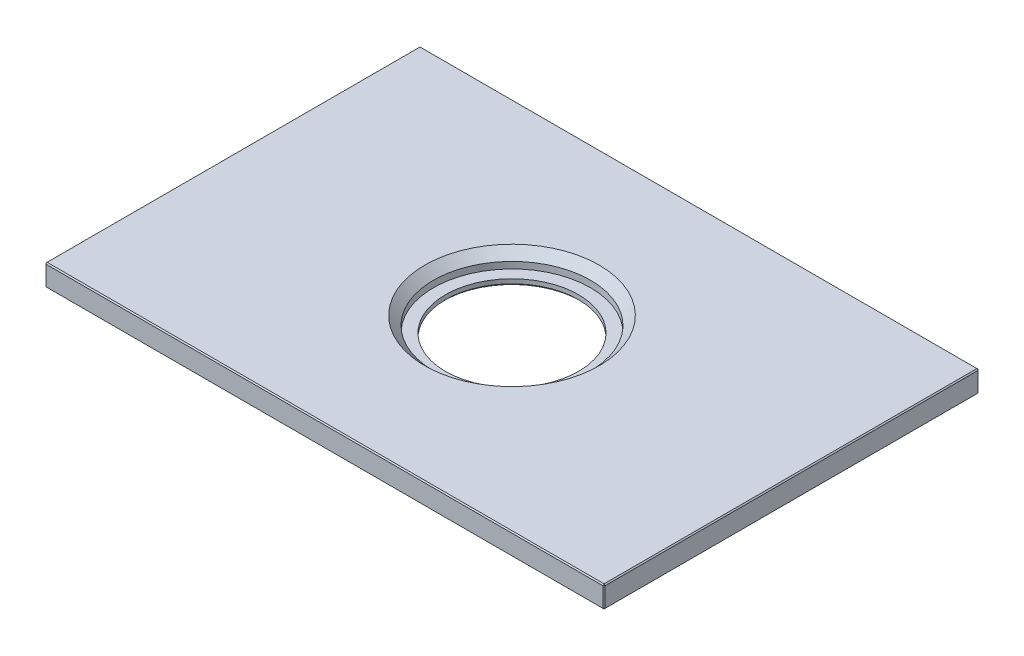
ISO-10303-21;
HEADER;
FILE_DESCRIPTION(('STEP AP214'),'2;1');
FILE_NAME('part.step','',(''),(''),'','','');
FILE_SCHEMA(('AUTOMOTIVE_DESIGN { 1 0 10303 214 1 1 1 1 }'));
ENDSEC;
DATA;
#1=APPLICATION_CONTEXT('core data for automotive mechanical design processes');
#2=APPLICATION_PROTOCOL_DEFINITION('international standard','automotive_design',2000,#1);
#3=PRODUCT_CONTEXT('',#1,'mechanical');
#4=PRODUCT('Part','Part','',(#3));
#5=PRODUCT_RELATED_PRODUCT_CATEGORY('part','',(#4));
#6=PRODUCT_DEFINITION_FORMATION('','',#4);
#7=PRODUCT_DEFINITION_CONTEXT('part definition',#1,'design');
#8=PRODUCT_DEFINITION('design','',#6,#7);
#9=PRODUCT_DEFINITION_SHAPE('','',#8);
#10=(LENGTH_UNIT() NAMED_UNIT(*) SI_UNIT(.MILLI.,.METRE.));
#11=(NAMED_UNIT(*) PLANE_ANGLE_UNIT() SI_UNIT($,.RADIAN.));
#12=(NAMED_UNIT(*) SI_UNIT($,.STERADIAN.) SOLID_ANGLE_UNIT());
#13=UNCERTAINTY_MEASURE_WITH_UNIT(LENGTH_MEASURE(1.E-05),#10,'distance_accuracy_value','');
#14=(GEOMETRIC_REPRESENTATION_CONTEXT(3) GLOBAL_UNCERTAINTY_ASSIGNED_CONTEXT((#13)) GLOBAL_UNIT_ASSIGNED_CONTEXT((#10,
#11,#12)) REPRESENTATION_CONTEXT('',''));
#15=CARTESIAN_POINT('',(0.,0.,0.));
#16=DIRECTION('',(0.,0.,1.));
#17=DIRECTION('',(1.,0.,0.));
#18=AXIS2_PLACEMENT_3D('',#15,#16,#17);
#19=CARTESIAN_POINT('',(64.1,5.,43.));
#20=DIRECTION('',(-1.,0.,0.));
#21=DIRECTION('',(0.,0.,1.));
#22=AXIS2_PLACEMENT_3D('',#19,#20,#21);
#23=PLANE('',#22);
#24=DIRECTION('',(0.,0.,1.));
#25=VECTOR('',#24,1.);
#26=CARTESIAN_POINT('',(64.1,4.74999999999999,43.));
#27=LINE('',#26,#25);
#28=CARTESIAN_POINT('',(64.1,4.74999999999999,-42.75));
#29=VERTEX_POINT('',#28);
#30=CARTESIAN_POINT('',(64.1,4.74999999999999,42.75));
#31=VERTEX_POINT('',#30);
#32=EDGE_CURVE('E137',#29,#31,#27,.T.);
#33=ORIENTED_EDGE('',*,*,#32,.T.);
#34=DIRECTION('',(0.,-1.,0.));
#35=VECTOR('',#34,1.);
#36=CARTESIAN_POINT('',(64.1,5.,42.75));
#37=LINE('',#36,#35);
#38=CARTESIAN_POINT('',(64.1,0.250000000000014,42.75));
#39=VERTEX_POINT('',#38);
#40=EDGE_CURVE('E197',#31,#39,#37,.T.);
#41=ORIENTED_EDGE('',*,*,#40,.T.);
#42=DIRECTION('',(0.,0.,-1.));
#43=VECTOR('',#42,1.);
#44=CARTESIAN_POINT('',(64.1,0.250000000000014,-43.));
#45=LINE('',#44,#43);
#46=CARTESIAN_POINT('',(64.1,0.250000000000014,-42.75));
#47=VERTEX_POINT('',#46);
#48=EDGE_CURVE('E194',#39,#47,#45,.T.);
#49=ORIENTED_EDGE('',*,*,#48,.T.);
#50=DIRECTION('',(0.,1.,0.));
#51=VECTOR('',#50,1.);
#52=CARTESIAN_POINT('',(64.1,5.,-42.75));
#53=LINE('',#52,#51);
#54=EDGE_CURVE('E192',#47,#29,#53,.T.);
#55=ORIENTED_EDGE('',*,*,#54,.T.);
#56=EDGE_LOOP('',(#33,#41,#49,#55));
#57=FACE_BOUND('',#56,.T.);
#58=ADVANCED_FACE('F31',(#57),#23,.F.);
#59=CARTESIAN_POINT('',(-64.1,5.,-43.));
#60=DIRECTION('',(0.,0.,1.));
#61=DIRECTION('',(1.,0.,0.));
#62=AXIS2_PLACEMENT_3D('',#59,#60,#61);
#63=PLANE('',#62);
#64=DIRECTION('',(1.,0.,0.));
#65=VECTOR('',#64,1.);
#66=CARTESIAN_POINT('',(-64.1,4.74999999999999,-43.));
#67=LINE('',#66,#65);
#68=CARTESIAN_POINT('',(-63.85,4.74999999999999,-43.));
#69=VERTEX_POINT('',#68);
#70=CARTESIAN_POINT('',(63.85,4.74999999999999,-43.));
#71=VERTEX_POINT('',#70);
#72=EDGE_CURVE('E40',#69,#71,#67,.T.);
#73=ORIENTED_EDGE('',*,*,#72,.T.);
#74=DIRECTION('',(0.,-1.,0.));
#75=VECTOR('',#74,1.);
#76=CARTESIAN_POINT('',(63.85,5.,-43.));
#77=LINE('',#76,#75);
#78=CARTESIAN_POINT('',(63.85,0.250000000000014,-43.));
#79=VERTEX_POINT('',#78);
#80=EDGE_CURVE('E11',#71,#79,#77,.T.);
#81=ORIENTED_EDGE('',*,*,#80,.T.);
#82=DIRECTION('',(-1.,0.,0.));
#83=VECTOR('',#82,1.);
#84=CARTESIAN_POINT('',(-64.1,0.250000000000014,-43.));
#85=LINE('',#84,#83);
#86=CARTESIAN_POINT('',(-63.85,0.250000000000014,-43.));
#87=VERTEX_POINT('',#86);
#88=EDGE_CURVE('E200',#79,#87,#85,.T.);
#89=ORIENTED_EDGE('',*,*,#88,.T.);
#90=DIRECTION('',(0.,1.,0.));
#91=VECTOR('',#90,1.);
#92=CARTESIAN_POINT('',(-63.85,5.,-43.));
#93=LINE('',#92,#91);
#94=EDGE_CURVE('E51',#87,#69,#93,.T.);
#95=ORIENTED_EDGE('',*,*,#94,.T.);
#96=EDGE_LOOP('',(#73,#81,#89,#95));
#97=FACE_BOUND('',#96,.T.);
#98=ADVANCED_FACE('F299',(#97),#63,.F.);
#99=CARTESIAN_POINT('',(-64.1,5.,43.));
#100=DIRECTION('',(1.,0.,0.));
#101=DIRECTION('',(0.,0.,-1.));
#102=AXIS2_PLACEMENT_3D('',#99,#100,#101);
#103=PLANE('',#102);
#104=DIRECTION('',(0.,0.,1.));
#105=VECTOR('',#104,1.);
#106=CARTESIAN_POINT('',(-64.1,0.250000000000014,43.));
#107=LINE('',#106,#105);
#108=CARTESIAN_POINT('',(-64.1,0.250000000000014,-42.75));
#109=VERTEX_POINT('',#108);
#110=CARTESIAN_POINT('',(-64.1,0.250000000000014,42.75));
#111=VERTEX_POINT('',#110);
#112=EDGE_CURVE('E167',#109,#111,#107,.T.);
#113=ORIENTED_EDGE('',*,*,#112,.T.);
#114=DIRECTION('',(0.,1.,0.));
#115=VECTOR('',#114,1.);
#116=CARTESIAN_POINT('',(-64.1,5.,42.75));
#117=LINE('',#116,#115);
#118=CARTESIAN_POINT('',(-64.1,4.74999999999999,42.75));
#119=VERTEX_POINT('',#118);
#120=EDGE_CURVE('E172',#111,#119,#117,.T.);
#121=ORIENTED_EDGE('',*,*,#120,.T.);
#122=DIRECTION('',(0.,0.,-1.));
#123=VECTOR('',#122,1.);
#124=CARTESIAN_POINT('',(-64.1,4.74999999999999,43.));
#125=LINE('',#124,#123);
#126=CARTESIAN_POINT('',(-64.1,4.74999999999999,-42.75));
#127=VERTEX_POINT('',#126);
#128=EDGE_CURVE('E169',#119,#127,#125,.T.);
#129=ORIENTED_EDGE('',*,*,#128,.T.);
#130=DIRECTION('',(0.,-1.,0.));
#131=VECTOR('',#130,1.);
#132=CARTESIAN_POINT('',(-64.1,5.,-42.75));
#133=LINE('',#132,#131);
#134=EDGE_CURVE('E165',#127,#109,#133,.T.);
#135=ORIENTED_EDGE('',*,*,#134,.T.);
#136=EDGE_LOOP('',(#113,#121,#129,#135));
#137=FACE_BOUND('',#136,.T.);
#138=ADVANCED_FACE('F305',(#137),#103,.F.);
#139=CARTESIAN_POINT('',(-64.1,5.,43.));
#140=DIRECTION('',(0.,0.,-1.));
#141=DIRECTION('',(-1.,0.,0.));
#142=AXIS2_PLACEMENT_3D('',#139,#140,#141);
#143=PLANE('',#142);
#144=DIRECTION('',(-1.,0.,0.));
#145=VECTOR('',#144,1.);
#146=CARTESIAN_POINT('',(-64.1,4.74999999999999,43.));
#147=LINE('',#146,#145);
#148=CARTESIAN_POINT('',(63.85,4.74999999999999,43.));
#149=VERTEX_POINT('',#148);
#150=CARTESIAN_POINT('',(-63.85,4.74999999999999,43.));
#151=VERTEX_POINT('',#150);
#152=EDGE_CURVE('E187',#149,#151,#147,.T.);
#153=ORIENTED_EDGE('',*,*,#152,.T.);
#154=DIRECTION('',(0.,-1.,0.));
#155=VECTOR('',#154,1.);
#156=CARTESIAN_POINT('',(-63.85,5.,43.));
#157=LINE('',#156,#155);
#158=CARTESIAN_POINT('',(-63.85,0.250000000000014,43.));
#159=VERTEX_POINT('',#158);
#160=EDGE_CURVE('E189',#151,#159,#157,.T.);
#161=ORIENTED_EDGE('',*,*,#160,.T.);
#162=DIRECTION('',(1.,0.,0.));
#163=VECTOR('',#162,1.);
#164=CARTESIAN_POINT('',(64.1,0.250000000000014,43.));
#165=LINE('',#164,#163);
#166=CARTESIAN_POINT('',(63.85,0.250000000000014,43.));
#167=VERTEX_POINT('',#166);
#168=EDGE_CURVE('E185',#159,#167,#165,.T.);
#169=ORIENTED_EDGE('',*,*,#168,.T.);
#170=DIRECTION('',(0.,1.,0.));
#171=VECTOR('',#170,1.);
#172=CARTESIAN_POINT('',(63.85,5.,43.));
#173=LINE('',#172,#171);
#174=EDGE_CURVE('E183',#167,#149,#173,.T.);
#175=ORIENTED_EDGE('',*,*,#174,.T.);
#176=EDGE_LOOP('',(#153,#161,#169,#175));
#177=FACE_BOUND('',#176,.T.);
#178=ADVANCED_FACE('F310',(#177),#143,.F.);
#179=CARTESIAN_POINT('',(64.1,5.,-43.));
#180=DIRECTION('',(0.,-1.,0.));
#181=DIRECTION('',(0.,0.,-1.));
#182=AXIS2_PLACEMENT_3D('',#179,#180,#181);
#183=PLANE('',#182);
#184=DIRECTION('',(-1.,0.,0.));
#185=VECTOR('',#184,1.);
#186=CARTESIAN_POINT('',(64.1,5.,-42.75));
#187=LINE('',#186,#185);
#188=CARTESIAN_POINT('',(63.85,5.,-42.75));
#189=VERTEX_POINT('',#188);
#190=CARTESIAN_POINT('',(-63.85,5.,-42.75));
#191=VERTEX_POINT('',#190);
#192=EDGE_CURVE('E124',#189,#191,#187,.T.);
#193=ORIENTED_EDGE('',*,*,#192,.T.);
#194=DIRECTION('',(0.,0.,1.));
#195=VECTOR('',#194,1.);
#196=CARTESIAN_POINT('',(-63.85,5.,-43.));
#197=LINE('',#196,#195);
#198=CARTESIAN_POINT('',(-63.85,5.,42.75));
#199=VERTEX_POINT('',#198);
#200=EDGE_CURVE('E163',#191,#199,#197,.T.);
#201=ORIENTED_EDGE('',*,*,#200,.T.);
#202=DIRECTION('',(1.,0.,0.));
#203=VECTOR('',#202,1.);
#204=CARTESIAN_POINT('',(64.1,5.,42.75));
#205=LINE('',#204,#203);
#206=CARTESIAN_POINT('',(63.85,5.,42.75));
#207=VERTEX_POINT('',#206);
#208=EDGE_CURVE('E127',#199,#207,#205,.T.);
#209=ORIENTED_EDGE('',*,*,#208,.T.);
#210=DIRECTION('',(0.,0.,-1.));
#211=VECTOR('',#210,1.);
#212=CARTESIAN_POINT('',(63.85,5.,-43.));
#213=LINE('',#212,#211);
#214=EDGE_CURVE('E118',#207,#189,#213,.T.);
#215=ORIENTED_EDGE('',*,*,#214,.T.);
#216=EDGE_LOOP('',(#193,#201,#209,#215));
#217=FACE_BOUND('',#216,.T.);
#218=CARTESIAN_POINT('',(0.,5.,0.));
#219=DIRECTION('',(0.,-1.,0.));
#220=DIRECTION('',(0.,0.,-1.));
#221=AXIS2_PLACEMENT_3D('',#218,#219,#220);
#222=CIRCLE('',#221,20.);
#223=CARTESIAN_POINT('',(0.,5.,-20.));
#224=VERTEX_POINT('',#223);
#225=EDGE_CURVE('E155',#224,#224,#222,.T.);
#226=ORIENTED_EDGE('',*,*,#225,.T.);
#227=EDGE_LOOP('',(#226));
#228=FACE_BOUND('',#227,.T.);
#229=ADVANCED_FACE('F120',(#217,#228),#183,.F.);
#230=CARTESIAN_POINT('',(64.1,0.,-43.));
#231=DIRECTION('',(0.,-1.,0.));
#232=DIRECTION('',(0.,0.,-1.));
#233=AXIS2_PLACEMENT_3D('',#230,#231,#232);
#234=PLANE('',#233);
#235=DIRECTION('',(-1.,0.,0.));
#236=VECTOR('',#235,1.);
#237=CARTESIAN_POINT('',(-64.1,0.,42.75));
#238=LINE('',#237,#236);
#239=CARTESIAN_POINT('',(63.85,0.,42.75));
#240=VERTEX_POINT('',#239);
#241=CARTESIAN_POINT('',(-63.85,0.,42.75));
#242=VERTEX_POINT('',#241);
#243=EDGE_CURVE('E178',#240,#242,#238,.T.);
#244=ORIENTED_EDGE('',*,*,#243,.T.);
#245=DIRECTION('',(0.,0.,-1.));
#246=VECTOR('',#245,1.);
#247=CARTESIAN_POINT('',(-63.85,0.,-43.));
#248=LINE('',#247,#246);
#249=CARTESIAN_POINT('',(-63.85,0.,-42.75));
#250=VERTEX_POINT('',#249);
#251=EDGE_CURVE('E180',#242,#250,#248,.T.);
#252=ORIENTED_EDGE('',*,*,#251,.T.);
#253=DIRECTION('',(1.,0.,0.));
#254=VECTOR('',#253,1.);
#255=CARTESIAN_POINT('',(64.1,0.,-42.75));
#256=LINE('',#255,#254);
#257=CARTESIAN_POINT('',(63.85,0.,-42.75));
#258=VERTEX_POINT('',#257);
#259=EDGE_CURVE('E174',#250,#258,#256,.T.);
#260=ORIENTED_EDGE('',*,*,#259,.T.);
#261=DIRECTION('',(0.,0.,1.));
#262=VECTOR('',#261,1.);
#263=CARTESIAN_POINT('',(63.85,0.,43.));
#264=LINE('',#263,#262);
#265=EDGE_CURVE('E176',#258,#240,#264,.T.);
#266=ORIENTED_EDGE('',*,*,#265,.T.);
#267=EDGE_LOOP('',(#244,#252,#260,#266));
#268=FACE_BOUND('',#267,.T.);
#269=CARTESIAN_POINT('',(0.,0.,0.));
#270=DIRECTION('',(0.,-1.,0.));
#271=DIRECTION('',(0.,0.,-1.));
#272=AXIS2_PLACEMENT_3D('',#269,#270,#271);
#273=CIRCLE('',#272,15.75);
#274=CARTESIAN_POINT('',(0.,0.,-15.75));
#275=VERTEX_POINT('',#274);
#276=EDGE_CURVE('E269',#275,#275,#273,.F.);
#277=ORIENTED_EDGE('',*,*,#276,.T.);
#278=EDGE_LOOP('',(#277));
#279=FACE_BOUND('',#278,.T.);
#280=ADVANCED_FACE('F315',(#268,#279),#234,.T.);
#281=CARTESIAN_POINT('',(0.,1.5,0.));
#282=DIRECTION('',(0.,1.,0.));
#283=DIRECTION('',(0.,0.,1.));
#284=AXIS2_PLACEMENT_3D('',#281,#282,#283);
#285=CYLINDRICAL_SURFACE('',#284,18.);
#286=CARTESIAN_POINT('',(0.,2.99999999999999,0.));
#287=DIRECTION('',(0.,-1.,0.));
#288=DIRECTION('',(0.,0.,-1.));
#289=AXIS2_PLACEMENT_3D('',#286,#287,#288);
#290=CIRCLE('',#289,18.);
#291=CARTESIAN_POINT('',(0.,2.99999999999999,-18.));
#292=VERTEX_POINT('',#291);
#293=EDGE_CURVE('E158',#292,#292,#290,.F.);
#294=ORIENTED_EDGE('',*,*,#293,.T.);
#295=EDGE_LOOP('',(#294));
#296=FACE_BOUND('',#295,.T.);
#297=CARTESIAN_POINT('',(0.,1.5,0.));
#298=DIRECTION('',(0.,1.,0.));
#299=DIRECTION('',(0.,0.,1.));
#300=AXIS2_PLACEMENT_3D('',#297,#298,#299);
#301=CIRCLE('',#300,18.);
#302=CARTESIAN_POINT('',(0.,1.5,18.));
#303=VERTEX_POINT('',#302);
#304=EDGE_CURVE('E264',#303,#303,#301,.T.);
#305=ORIENTED_EDGE('',*,*,#304,.F.);
#306=EDGE_LOOP('',(#305));
#307=FACE_BOUND('',#306,.T.);
#308=ADVANCED_FACE('F279',(#296,#307),#285,.F.);
#309=CARTESIAN_POINT('',(0.,1.5,0.));
#310=DIRECTION('',(0.,1.,0.));
#311=DIRECTION('',(0.,0.,1.));
#312=AXIS2_PLACEMENT_3D('',#309,#310,#311);
#313=PLANE('',#312);
#314=CARTESIAN_POINT('',(0.,1.5,0.));
#315=DIRECTION('',(0.,1.,0.));
#316=DIRECTION('',(0.,0.,1.));
#317=AXIS2_PLACEMENT_3D('',#314,#315,#316);
#318=CIRCLE('',#317,15.25);
#319=CARTESIAN_POINT('',(0.,1.5,15.25));
#320=VERTEX_POINT('',#319);
#321=EDGE_CURVE('E258',#320,#320,#318,.T.);
#322=ORIENTED_EDGE('',*,*,#321,.F.);
#323=EDGE_LOOP('',(#322));
#324=FACE_BOUND('',#323,.T.);
#325=ORIENTED_EDGE('',*,*,#304,.T.);
#326=EDGE_LOOP('',(#325));
#327=FACE_BOUND('',#326,.T.);
#328=ADVANCED_FACE('F323',(#324,#327),#313,.T.);
#329=CARTESIAN_POINT('',(0.,0.,0.));
#330=DIRECTION('',(0.,1.,0.));
#331=DIRECTION('',(0.,0.,1.));
#332=AXIS2_PLACEMENT_3D('',#329,#330,#331);
#333=CYLINDRICAL_SURFACE('',#332,15.25);
#334=CARTESIAN_POINT('',(0.,0.49999999999999,0.));
#335=DIRECTION('',(0.,-1.,0.));
#336=DIRECTION('',(0.,0.,-1.));
#337=AXIS2_PLACEMENT_3D('',#334,#335,#336);
#338=CIRCLE('',#337,15.25);
#339=CARTESIAN_POINT('',(0.,0.49999999999999,-15.25));
#340=VERTEX_POINT('',#339);
#341=EDGE_CURVE('E274',#340,#340,#338,.T.);
#342=ORIENTED_EDGE('',*,*,#341,.T.);
#343=EDGE_LOOP('',(#342));
#344=FACE_BOUND('',#343,.T.);
#345=ORIENTED_EDGE('',*,*,#321,.T.);
#346=EDGE_LOOP('',(#345));
#347=FACE_BOUND('',#346,.T.);
#348=ADVANCED_FACE('F293',(#344,#347),#333,.F.);
#349=CARTESIAN_POINT('',(0.,0.,0.));
#350=DIRECTION('',(0.,-1.,0.));
#351=DIRECTION('',(0.,0.,-1.));
#352=AXIS2_PLACEMENT_3D('',#349,#350,#351);
#353=CONICAL_SURFACE('',#352,15.75,0.785398163397445);
#354=ORIENTED_EDGE('',*,*,#341,.F.);
#355=EDGE_LOOP('',(#354));
#356=FACE_BOUND('',#355,.T.);
#357=ORIENTED_EDGE('',*,*,#276,.F.);
#358=EDGE_LOOP('',(#357));
#359=FACE_BOUND('',#358,.T.);
#360=ADVANCED_FACE('F284',(#356,#359),#353,.F.);
#361=CARTESIAN_POINT('',(0.,2.99999999999999,0.));
#362=DIRECTION('',(0.,1.,0.));
#363=DIRECTION('',(0.,0.,1.));
#364=AXIS2_PLACEMENT_3D('',#361,#362,#363);
#365=CONICAL_SURFACE('',#364,18.,0.785398163397451);
#366=ORIENTED_EDGE('',*,*,#225,.F.);
#367=EDGE_LOOP('',(#366));
#368=FACE_BOUND('',#367,.T.);
#369=ORIENTED_EDGE('',*,*,#293,.F.);
#370=EDGE_LOOP('',(#369));
#371=FACE_BOUND('',#370,.T.);
#372=ADVANCED_FACE('F282',(#368,#371),#365,.F.);
#373=CARTESIAN_POINT('',(64.1,0.250000000000014,43.));
#374=DIRECTION('',(0.707106781186548,-0.707106781186548,0.));
#375=DIRECTION('',(0.707106781186548,0.707106781186548,0.));
#376=AXIS2_PLACEMENT_3D('',#373,#374,#375);
#377=PLANE('',#376);
#378=DIRECTION('',(-0.707106781186548,-0.707106781186548,0.));
#379=VECTOR('',#378,1.);
#380=CARTESIAN_POINT('',(64.1,0.250000000000014,-42.75));
#381=LINE('',#380,#379);
#382=EDGE_CURVE('E35',#47,#258,#381,.T.);
#383=ORIENTED_EDGE('',*,*,#382,.F.);
#384=ORIENTED_EDGE('',*,*,#48,.F.);
#385=DIRECTION('',(0.707106781186548,0.707106781186548,0.));
#386=VECTOR('',#385,1.);
#387=CARTESIAN_POINT('',(63.975,0.125,42.75));
#388=LINE('',#387,#386);
#389=EDGE_CURVE('E250',#240,#39,#388,.T.);
#390=ORIENTED_EDGE('',*,*,#389,.F.);
#391=ORIENTED_EDGE('',*,*,#265,.F.);
#392=EDGE_LOOP('',(#383,#384,#390,#391));
#393=FACE_BOUND('',#392,.T.);
#394=ADVANCED_FACE('F33',(#393),#377,.T.);
#395=CARTESIAN_POINT('',(64.1,0.250000000000014,-42.75));
#396=DIRECTION('',(0.577350269189615,-0.577350269189615,-0.577350269189647));
#397=DIRECTION('',(-0.707106781186567,0.,-0.707106781186528));
#398=AXIS2_PLACEMENT_3D('',#395,#396,#397);
#399=PLANE('',#398);
#400=DIRECTION('',(-0.707106781186567,0.,-0.707106781186528));
#401=VECTOR('',#400,1.);
#402=CARTESIAN_POINT('',(64.1,0.250000000000014,-42.75));
#403=LINE('',#402,#401);
#404=EDGE_CURVE('E245',#47,#79,#403,.T.);
#405=ORIENTED_EDGE('',*,*,#404,.F.);
#406=ORIENTED_EDGE('',*,*,#382,.T.);
#407=DIRECTION('',(0.,0.707106781186548,-0.707106781186548));
#408=VECTOR('',#407,1.);
#409=CARTESIAN_POINT('',(63.85,0.125,-42.875));
#410=LINE('',#409,#408);
#411=EDGE_CURVE('E248',#79,#258,#410,.F.);
#412=ORIENTED_EDGE('',*,*,#411,.F.);
#413=EDGE_LOOP('',(#405,#406,#412));
#414=FACE_BOUND('',#413,.T.);
#415=ADVANCED_FACE('F291',(#414),#399,.T.);
#416=CARTESIAN_POINT('',(63.85,0.250000000000014,43.));
#417=DIRECTION('',(0.577350269189615,-0.577350269189615,0.577350269189647));
#418=DIRECTION('',(0.707106781186567,0.,-0.707106781186528));
#419=AXIS2_PLACEMENT_3D('',#416,#417,#418);
#420=PLANE('',#419);
#421=DIRECTION('',(0.,-0.707106781186548,-0.707106781186548));
#422=VECTOR('',#421,1.);
#423=CARTESIAN_POINT('',(63.85,0.250000000000014,43.));
#424=LINE('',#423,#422);
#425=EDGE_CURVE('E240',#240,#167,#424,.F.);
#426=ORIENTED_EDGE('',*,*,#425,.F.);
#427=ORIENTED_EDGE('',*,*,#389,.T.);
#428=DIRECTION('',(0.707106781186567,0.,-0.707106781186528));
#429=VECTOR('',#428,1.);
#430=CARTESIAN_POINT('',(63.85,0.250000000000014,43.));
#431=LINE('',#430,#429);
#432=EDGE_CURVE('E243',#167,#39,#431,.T.);
#433=ORIENTED_EDGE('',*,*,#432,.F.);
#434=EDGE_LOOP('',(#426,#427,#433));
#435=FACE_BOUND('',#434,.T.);
#436=ADVANCED_FACE('F401',(#435),#420,.T.);
#437=CARTESIAN_POINT('',(-64.1,0.250000000000014,-43.));
#438=DIRECTION('',(0.,-0.707106781186548,-0.707106781186548));
#439=DIRECTION('',(0.,0.707106781186548,-0.707106781186548));
#440=AXIS2_PLACEMENT_3D('',#437,#438,#439);
#441=PLANE('',#440);
#442=ORIENTED_EDGE('',*,*,#411,.T.);
#443=ORIENTED_EDGE('',*,*,#259,.F.);
#444=DIRECTION('',(0.,-0.707106781186548,0.707106781186548));
#445=VECTOR('',#444,1.);
#446=CARTESIAN_POINT('',(-63.85,0.,-42.75));
#447=LINE('',#446,#445);
#448=EDGE_CURVE('E235',#87,#250,#447,.T.);
#449=ORIENTED_EDGE('',*,*,#448,.F.);
#450=ORIENTED_EDGE('',*,*,#88,.F.);
#451=EDGE_LOOP('',(#442,#443,#449,#450));
#452=FACE_BOUND('',#451,.T.);
#453=ADVANCED_FACE('F409',(#452),#441,.T.);
#454=CARTESIAN_POINT('',(63.85,5.,-43.));
#455=DIRECTION('',(-0.707106781186528,0.,0.707106781186567));
#456=DIRECTION('',(0.707106781186567,0.,0.707106781186528));
#457=AXIS2_PLACEMENT_3D('',#454,#455,#456);
#458=PLANE('',#457);
#459=ORIENTED_EDGE('',*,*,#404,.T.);
#460=ORIENTED_EDGE('',*,*,#80,.F.);
#461=DIRECTION('',(0.707106781186567,0.,0.707106781186528));
#462=VECTOR('',#461,1.);
#463=CARTESIAN_POINT('',(63.975,4.74999999999999,-42.875));
#464=LINE('',#463,#462);
#465=EDGE_CURVE('E141',#29,#71,#464,.F.);
#466=ORIENTED_EDGE('',*,*,#465,.F.);
#467=ORIENTED_EDGE('',*,*,#54,.F.);
#468=EDGE_LOOP('',(#459,#460,#466,#467));
#469=FACE_BOUND('',#468,.T.);
#470=ADVANCED_FACE('F418',(#469),#458,.F.);
#471=CARTESIAN_POINT('',(63.85,5.,-43.));
#472=DIRECTION('',(-0.707106781186548,-0.707106781186548,0.));
#473=DIRECTION('',(0.707106781186548,-0.707106781186548,0.));
#474=AXIS2_PLACEMENT_3D('',#471,#472,#473);
#475=PLANE('',#474);
#476=DIRECTION('',(0.707106781186548,-0.707106781186548,0.));
#477=VECTOR('',#476,1.);
#478=CARTESIAN_POINT('',(63.85,5.,42.75));
#479=LINE('',#478,#477);
#480=EDGE_CURVE('E142',#31,#207,#479,.F.);
#481=ORIENTED_EDGE('',*,*,#480,.F.);
#482=ORIENTED_EDGE('',*,*,#32,.F.);
#483=DIRECTION('',(-0.707106781186548,0.707106781186548,0.));
#484=VECTOR('',#483,1.);
#485=CARTESIAN_POINT('',(63.85,5.,-42.75));
#486=LINE('',#485,#484);
#487=EDGE_CURVE('E134',#189,#29,#486,.F.);
#488=ORIENTED_EDGE('',*,*,#487,.F.);
#489=ORIENTED_EDGE('',*,*,#214,.F.);
#490=EDGE_LOOP('',(#481,#482,#488,#489));
#491=FACE_BOUND('',#490,.T.);
#492=ADVANCED_FACE('F136',(#491),#475,.F.);
#493=CARTESIAN_POINT('',(64.1,5.,42.75));
#494=DIRECTION('',(-0.707106781186528,0.,-0.707106781186567));
#495=DIRECTION('',(-0.707106781186567,0.,0.707106781186528));
#496=AXIS2_PLACEMENT_3D('',#493,#494,#495);
#497=PLANE('',#496);
#498=ORIENTED_EDGE('',*,*,#432,.T.);
#499=ORIENTED_EDGE('',*,*,#40,.F.);
#500=DIRECTION('',(-0.707106781186567,0.,0.707106781186528));
#501=VECTOR('',#500,1.);
#502=CARTESIAN_POINT('',(63.975,4.74999999999999,42.875));
#503=LINE('',#502,#501);
#504=EDGE_CURVE('E230',#149,#31,#503,.F.);
#505=ORIENTED_EDGE('',*,*,#504,.F.);
#506=ORIENTED_EDGE('',*,*,#174,.F.);
#507=EDGE_LOOP('',(#498,#499,#505,#506));
#508=FACE_BOUND('',#507,.T.);
#509=ADVANCED_FACE('F437',(#508),#497,.F.);
#510=CARTESIAN_POINT('',(-64.1,0.250000000000014,43.));
#511=DIRECTION('',(0.,-0.707106781186548,0.707106781186548));
#512=DIRECTION('',(0.,-0.707106781186548,-0.707106781186548));
#513=AXIS2_PLACEMENT_3D('',#510,#511,#512);
#514=PLANE('',#513);
#515=ORIENTED_EDGE('',*,*,#425,.T.);
#516=ORIENTED_EDGE('',*,*,#168,.F.);
#517=DIRECTION('',(0.,0.707106781186548,0.707106781186548));
#518=VECTOR('',#517,1.);
#519=CARTESIAN_POINT('',(-63.85,0.125000000000014,42.875));
#520=LINE('',#519,#518);
#521=EDGE_CURVE('E227',#242,#159,#520,.T.);
#522=ORIENTED_EDGE('',*,*,#521,.F.);
#523=ORIENTED_EDGE('',*,*,#243,.F.);
#524=EDGE_LOOP('',(#515,#516,#522,#523));
#525=FACE_BOUND('',#524,.T.);
#526=ADVANCED_FACE('F446',(#525),#514,.T.);
#527=CARTESIAN_POINT('',(-64.1,0.250000000000014,43.));
#528=DIRECTION('',(-0.707106781186528,-0.707106781186567,0.));
#529=DIRECTION('',(0.707106781186567,-0.707106781186528,0.));
#530=AXIS2_PLACEMENT_3D('',#527,#528,#529);
#531=PLANE('',#530);
#532=DIRECTION('',(-0.707106781186567,0.707106781186528,0.));
#533=VECTOR('',#532,1.);
#534=CARTESIAN_POINT('',(-63.85,0.,-42.75));
#535=LINE('',#534,#533);
#536=EDGE_CURVE('E237',#250,#109,#535,.T.);
#537=ORIENTED_EDGE('',*,*,#536,.F.);
#538=ORIENTED_EDGE('',*,*,#251,.F.);
#539=DIRECTION('',(0.707106781186567,-0.707106781186528,0.));
#540=VECTOR('',#539,1.);
#541=CARTESIAN_POINT('',(-64.1,0.250000000000014,42.75));
#542=LINE('',#541,#540);
#543=EDGE_CURVE('E224',#111,#242,#542,.T.);
#544=ORIENTED_EDGE('',*,*,#543,.F.);
#545=ORIENTED_EDGE('',*,*,#112,.F.);
#546=EDGE_LOOP('',(#537,#538,#544,#545));
#547=FACE_BOUND('',#546,.T.);
#548=ADVANCED_FACE('F456',(#547),#531,.T.);
#549=CARTESIAN_POINT('',(-63.85,0.,-42.75));
#550=DIRECTION('',(-0.577350269189615,-0.577350269189647,-0.577350269189615));
#551=DIRECTION('',(0.,0.707106781186528,-0.707106781186567));
#552=AXIS2_PLACEMENT_3D('',#549,#550,#551);
#553=PLANE('',#552);
#554=ORIENTED_EDGE('',*,*,#448,.T.);
#555=ORIENTED_EDGE('',*,*,#536,.T.);
#556=DIRECTION('',(-0.707106781186548,0.,0.707106781186548));
#557=VECTOR('',#556,1.);
#558=CARTESIAN_POINT('',(-63.975,0.250000000000014,-42.875));
#559=LINE('',#558,#557);
#560=EDGE_CURVE('E148',#87,#109,#559,.T.);
#561=ORIENTED_EDGE('',*,*,#560,.F.);
#562=EDGE_LOOP('',(#554,#555,#561));
#563=FACE_BOUND('',#562,.T.);
#564=ADVANCED_FACE('F466',(#563),#553,.T.);
#565=CARTESIAN_POINT('',(63.85,5.,-42.75));
#566=DIRECTION('',(0.577350269189615,0.577350269189615,-0.577350269189647));
#567=DIRECTION('',(-0.707106781186567,0.,-0.707106781186528));
#568=AXIS2_PLACEMENT_3D('',#565,#566,#567);
#569=PLANE('',#568);
#570=ORIENTED_EDGE('',*,*,#487,.T.);
#571=ORIENTED_EDGE('',*,*,#465,.T.);
#572=DIRECTION('',(0.,-0.707106781186548,-0.707106781186548));
#573=VECTOR('',#572,1.);
#574=CARTESIAN_POINT('',(63.85,5.,-42.75));
#575=LINE('',#574,#573);
#576=EDGE_CURVE('E145',#189,#71,#575,.T.);
#577=ORIENTED_EDGE('',*,*,#576,.F.);
#578=EDGE_LOOP('',(#570,#571,#577));
#579=FACE_BOUND('',#578,.T.);
#580=ADVANCED_FACE('F146',(#579),#569,.T.);
#581=CARTESIAN_POINT('',(63.85,5.,42.75));
#582=DIRECTION('',(0.577350269189615,0.577350269189615,0.577350269189647));
#583=DIRECTION('',(0.707106781186567,0.,-0.707106781186528));
#584=AXIS2_PLACEMENT_3D('',#581,#582,#583);
#585=PLANE('',#584);
#586=ORIENTED_EDGE('',*,*,#504,.T.);
#587=ORIENTED_EDGE('',*,*,#480,.T.);
#588=DIRECTION('',(0.,0.707106781186548,-0.707106781186548));
#589=VECTOR('',#588,1.);
#590=CARTESIAN_POINT('',(63.85,5.,42.75));
#591=LINE('',#590,#589);
#592=EDGE_CURVE('E149',#149,#207,#591,.T.);
#593=ORIENTED_EDGE('',*,*,#592,.F.);
#594=EDGE_LOOP('',(#586,#587,#593));
#595=FACE_BOUND('',#594,.T.);
#596=ADVANCED_FACE('F485',(#595),#585,.T.);
#597=CARTESIAN_POINT('',(-64.1,0.250000000000014,42.75));
#598=DIRECTION('',(-0.577350269189615,-0.577350269189647,0.577350269189615));
#599=DIRECTION('',(0.,-0.707106781186528,-0.707106781186567));
#600=AXIS2_PLACEMENT_3D('',#597,#598,#599);
#601=PLANE('',#600);
#602=ORIENTED_EDGE('',*,*,#543,.T.);
#603=ORIENTED_EDGE('',*,*,#521,.T.);
#604=DIRECTION('',(0.707106781186548,0.,0.707106781186548));
#605=VECTOR('',#604,1.);
#606=CARTESIAN_POINT('',(-64.1,0.250000000000014,42.75));
#607=LINE('',#606,#605);
#608=EDGE_CURVE('E218',#111,#159,#607,.T.);
#609=ORIENTED_EDGE('',*,*,#608,.F.);
#610=EDGE_LOOP('',(#602,#603,#609));
#611=FACE_BOUND('',#610,.T.);
#612=ADVANCED_FACE('F494',(#611),#601,.T.);
#613=CARTESIAN_POINT('',(-64.1,5.,-42.75));
#614=DIRECTION('',(0.707106781186548,0.,0.707106781186548));
#615=DIRECTION('',(0.707106781186548,0.,-0.707106781186548));
#616=AXIS2_PLACEMENT_3D('',#613,#614,#615);
#617=PLANE('',#616);
#618=ORIENTED_EDGE('',*,*,#560,.T.);
#619=ORIENTED_EDGE('',*,*,#134,.F.);
#620=DIRECTION('',(0.707106781186548,0.,-0.707106781186548));
#621=VECTOR('',#620,1.);
#622=CARTESIAN_POINT('',(-64.1,4.74999999999999,-42.75));
#623=LINE('',#622,#621);
#624=EDGE_CURVE('E215',#69,#127,#623,.F.);
#625=ORIENTED_EDGE('',*,*,#624,.F.);
#626=ORIENTED_EDGE('',*,*,#94,.F.);
#627=EDGE_LOOP('',(#618,#619,#625,#626));
#628=FACE_BOUND('',#627,.T.);
#629=ADVANCED_FACE('F504',(#628),#617,.F.);
#630=CARTESIAN_POINT('',(64.1,5.,-42.75));
#631=DIRECTION('',(0.,-0.707106781186548,0.707106781186548));
#632=DIRECTION('',(0.,-0.707106781186548,-0.707106781186548));
#633=AXIS2_PLACEMENT_3D('',#630,#631,#632);
#634=PLANE('',#633);
#635=ORIENTED_EDGE('',*,*,#576,.T.);
#636=ORIENTED_EDGE('',*,*,#72,.F.);
#637=DIRECTION('',(0.,0.707106781186548,0.707106781186548));
#638=VECTOR('',#637,1.);
#639=CARTESIAN_POINT('',(-63.85,4.87499999999999,-42.875));
#640=LINE('',#639,#638);
#641=EDGE_CURVE('E153',#191,#69,#640,.F.);
#642=ORIENTED_EDGE('',*,*,#641,.F.);
#643=ORIENTED_EDGE('',*,*,#192,.F.);
#644=EDGE_LOOP('',(#635,#636,#642,#643));
#645=FACE_BOUND('',#644,.T.);
#646=ADVANCED_FACE('F151',(#645),#634,.F.);
#647=CARTESIAN_POINT('',(64.1,5.,42.75));
#648=DIRECTION('',(0.,-0.707106781186548,-0.707106781186548));
#649=DIRECTION('',(0.,0.707106781186548,-0.707106781186548));
#650=AXIS2_PLACEMENT_3D('',#647,#648,#649);
#651=PLANE('',#650);
#652=ORIENTED_EDGE('',*,*,#592,.T.);
#653=ORIENTED_EDGE('',*,*,#208,.F.);
#654=DIRECTION('',(0.,-0.707106781186548,0.707106781186548));
#655=VECTOR('',#654,1.);
#656=CARTESIAN_POINT('',(-63.85,5.,42.75));
#657=LINE('',#656,#655);
#658=EDGE_CURVE('E211',#151,#199,#657,.F.);
#659=ORIENTED_EDGE('',*,*,#658,.F.);
#660=ORIENTED_EDGE('',*,*,#152,.F.);
#661=EDGE_LOOP('',(#652,#653,#659,#660));
#662=FACE_BOUND('',#661,.T.);
#663=ADVANCED_FACE('F523',(#662),#651,.F.);
#664=CARTESIAN_POINT('',(-63.85,5.,43.));
#665=DIRECTION('',(0.707106781186548,0.,-0.707106781186548));
#666=DIRECTION('',(-0.707106781186548,0.,-0.707106781186548));
#667=AXIS2_PLACEMENT_3D('',#664,#665,#666);
#668=PLANE('',#667);
#669=ORIENTED_EDGE('',*,*,#608,.T.);
#670=ORIENTED_EDGE('',*,*,#160,.F.);
#671=DIRECTION('',(-0.707106781186548,0.,-0.707106781186548));
#672=VECTOR('',#671,1.);
#673=CARTESIAN_POINT('',(-63.975,4.74999999999999,42.875));
#674=LINE('',#673,#672);
#675=EDGE_CURVE('E208',#119,#151,#674,.F.);
#676=ORIENTED_EDGE('',*,*,#675,.F.);
#677=ORIENTED_EDGE('',*,*,#120,.F.);
#678=EDGE_LOOP('',(#669,#670,#676,#677));
#679=FACE_BOUND('',#678,.T.);
#680=ADVANCED_FACE('F532',(#679),#668,.F.);
#681=CARTESIAN_POINT('',(-64.1,4.74999999999999,-42.75));
#682=DIRECTION('',(-0.577350269189615,0.577350269189647,-0.577350269189615));
#683=DIRECTION('',(0.,0.707106781186528,0.707106781186567));
#684=AXIS2_PLACEMENT_3D('',#681,#682,#683);
#685=PLANE('',#684);
#686=ORIENTED_EDGE('',*,*,#641,.T.);
#687=ORIENTED_EDGE('',*,*,#624,.T.);
#688=DIRECTION('',(-0.707106781186567,-0.707106781186528,0.));
#689=VECTOR('',#688,1.);
#690=CARTESIAN_POINT('',(-64.1,4.74999999999999,-42.75));
#691=LINE('',#690,#689);
#692=EDGE_CURVE('E206',#191,#127,#691,.T.);
#693=ORIENTED_EDGE('',*,*,#692,.F.);
#694=EDGE_LOOP('',(#686,#687,#693));
#695=FACE_BOUND('',#694,.T.);
#696=ADVANCED_FACE('F542',(#695),#685,.T.);
#697=CARTESIAN_POINT('',(-63.85,5.,42.75));
#698=DIRECTION('',(-0.577350269189615,0.577350269189647,0.577350269189615));
#699=DIRECTION('',(0.,-0.707106781186528,0.707106781186567));
#700=AXIS2_PLACEMENT_3D('',#697,#698,#699);
#701=PLANE('',#700);
#702=ORIENTED_EDGE('',*,*,#675,.T.);
#703=ORIENTED_EDGE('',*,*,#658,.T.);
#704=DIRECTION('',(0.707106781186567,0.707106781186528,0.));
#705=VECTOR('',#704,1.);
#706=CARTESIAN_POINT('',(-63.85,5.,42.75));
#707=LINE('',#706,#705);
#708=EDGE_CURVE('E204',#119,#199,#707,.T.);
#709=ORIENTED_EDGE('',*,*,#708,.F.);
#710=EDGE_LOOP('',(#702,#703,#709));
#711=FACE_BOUND('',#710,.T.);
#712=ADVANCED_FACE('F552',(#711),#701,.T.);
#713=CARTESIAN_POINT('',(-63.85,5.,-43.));
#714=DIRECTION('',(0.707106781186528,-0.707106781186567,0.));
#715=DIRECTION('',(0.707106781186567,0.707106781186528,0.));
#716=AXIS2_PLACEMENT_3D('',#713,#714,#715);
#717=PLANE('',#716);
#718=ORIENTED_EDGE('',*,*,#692,.T.);
#719=ORIENTED_EDGE('',*,*,#128,.F.);
#720=ORIENTED_EDGE('',*,*,#708,.T.);
#721=ORIENTED_EDGE('',*,*,#200,.F.);
#722=EDGE_LOOP('',(#718,#719,#720,#721));
#723=FACE_BOUND('',#722,.T.);
#724=ADVANCED_FACE('F562',(#723),#717,.F.);
#725=CLOSED_SHELL('',(#58,#98,#138,#178,#229,#280,#308,#328,#348,#360,#372,#394,#415,#436,#453,
#470,#492,#509,#526,#548,#564,#580,#596,#612,#629,#646,#663,#680,#696,#712,#724));
#726=MANIFOLD_SOLID_BREP('B2',#725);
#727=ADVANCED_BREP_SHAPE_REPRESENTATION('',(#18,#726),#14);
#728=SHAPE_DEFINITION_REPRESENTATION(#9,#727);
ENDSEC;
END-ISO-10303-21;
